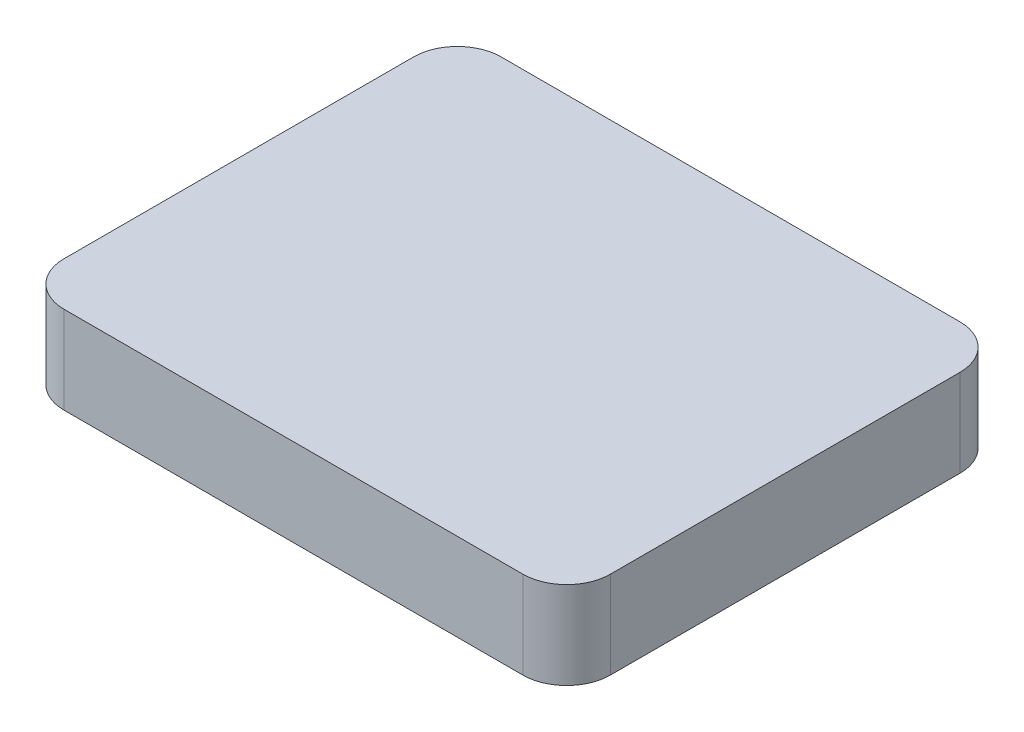
ISO-10303-21;
HEADER;
FILE_DESCRIPTION(('STEP AP214'),'2;1');
FILE_NAME('part.step','',(''),(''),'','','');
FILE_SCHEMA(('AUTOMOTIVE_DESIGN { 1 0 10303 214 1 1 1 1 }'));
ENDSEC;
DATA;
#1=APPLICATION_CONTEXT('core data for automotive mechanical design processes');
#2=APPLICATION_PROTOCOL_DEFINITION('international standard','automotive_design',2000,#1);
#3=PRODUCT_CONTEXT('',#1,'mechanical');
#4=PRODUCT('Part','Part','',(#3));
#5=PRODUCT_RELATED_PRODUCT_CATEGORY('part','',(#4));
#6=PRODUCT_DEFINITION_FORMATION('','',#4);
#7=PRODUCT_DEFINITION_CONTEXT('part definition',#1,'design');
#8=PRODUCT_DEFINITION('design','',#6,#7);
#9=PRODUCT_DEFINITION_SHAPE('','',#8);
#10=(LENGTH_UNIT() NAMED_UNIT(*) SI_UNIT(.MILLI.,.METRE.));
#11=(NAMED_UNIT(*) PLANE_ANGLE_UNIT() SI_UNIT($,.RADIAN.));
#12=(NAMED_UNIT(*) SI_UNIT($,.STERADIAN.) SOLID_ANGLE_UNIT());
#13=UNCERTAINTY_MEASURE_WITH_UNIT(LENGTH_MEASURE(1.E-05),#10,'distance_accuracy_value','');
#14=(GEOMETRIC_REPRESENTATION_CONTEXT(3) GLOBAL_UNCERTAINTY_ASSIGNED_CONTEXT((#13)) GLOBAL_UNIT_ASSIGNED_CONTEXT((#10,
#11,#12)) REPRESENTATION_CONTEXT('',''));
#15=CARTESIAN_POINT('',(0.,0.,0.));
#16=DIRECTION('',(0.,0.,1.));
#17=DIRECTION('',(1.,0.,0.));
#18=AXIS2_PLACEMENT_3D('',#15,#16,#17);
#19=CARTESIAN_POINT('',(125.,40.,-100.));
#20=DIRECTION('',(-1.,0.,0.));
#21=DIRECTION('',(0.,0.,1.));
#22=AXIS2_PLACEMENT_3D('',#19,#20,#21);
#23=PLANE('',#22);
#24=DIRECTION('',(0.,0.,-1.));
#25=VECTOR('',#24,1.);
#26=CARTESIAN_POINT('',(125.,0.,-100.));
#27=LINE('',#26,#25);
#28=CARTESIAN_POINT('',(125.,0.,80.));
#29=VERTEX_POINT('',#28);
#30=CARTESIAN_POINT('',(125.,0.,-80.));
#31=VERTEX_POINT('',#30);
#32=EDGE_CURVE('E162',#29,#31,#27,.T.);
#33=ORIENTED_EDGE('',*,*,#32,.T.);
#34=DIRECTION('',(0.,-1.,0.));
#35=VECTOR('',#34,1.);
#36=CARTESIAN_POINT('',(125.,40.,-80.));
#37=LINE('',#36,#35);
#38=CARTESIAN_POINT('',(125.,40.,-80.));
#39=VERTEX_POINT('',#38);
#40=EDGE_CURVE('E11',#31,#39,#37,.F.);
#41=ORIENTED_EDGE('',*,*,#40,.T.);
#42=DIRECTION('',(0.,0.,-1.));
#43=VECTOR('',#42,1.);
#44=CARTESIAN_POINT('',(125.,40.,-100.));
#45=LINE('',#44,#43);
#46=CARTESIAN_POINT('',(125.,40.,80.));
#47=VERTEX_POINT('',#46);
#48=EDGE_CURVE('E130',#47,#39,#45,.T.);
#49=ORIENTED_EDGE('',*,*,#48,.F.);
#50=DIRECTION('',(0.,-1.,0.));
#51=VECTOR('',#50,1.);
#52=CARTESIAN_POINT('',(125.,40.,80.));
#53=LINE('',#52,#51);
#54=EDGE_CURVE('E46',#47,#29,#53,.T.);
#55=ORIENTED_EDGE('',*,*,#54,.T.);
#56=EDGE_LOOP('',(#33,#41,#49,#55));
#57=FACE_BOUND('',#56,.T.);
#58=ADVANCED_FACE('F38',(#57),#23,.F.);
#59=CARTESIAN_POINT('',(-125.,40.,-100.));
#60=DIRECTION('',(0.,0.,1.));
#61=DIRECTION('',(1.,0.,0.));
#62=AXIS2_PLACEMENT_3D('',#59,#60,#61);
#63=PLANE('',#62);
#64=DIRECTION('',(-1.,0.,0.));
#65=VECTOR('',#64,1.);
#66=CARTESIAN_POINT('',(-125.,0.,-100.));
#67=LINE('',#66,#65);
#68=CARTESIAN_POINT('',(105.,0.,-100.));
#69=VERTEX_POINT('',#68);
#70=CARTESIAN_POINT('',(-105.,0.,-100.));
#71=VERTEX_POINT('',#70);
#72=EDGE_CURVE('E135',#69,#71,#67,.T.);
#73=ORIENTED_EDGE('',*,*,#72,.T.);
#74=DIRECTION('',(0.,-1.,0.));
#75=VECTOR('',#74,1.);
#76=CARTESIAN_POINT('',(-105.,40.,-100.));
#77=LINE('',#76,#75);
#78=CARTESIAN_POINT('',(-105.,40.,-100.));
#79=VERTEX_POINT('',#78);
#80=EDGE_CURVE('E53',#71,#79,#77,.F.);
#81=ORIENTED_EDGE('',*,*,#80,.T.);
#82=DIRECTION('',(-1.,0.,0.));
#83=VECTOR('',#82,1.);
#84=CARTESIAN_POINT('',(-125.,40.,-100.));
#85=LINE('',#84,#83);
#86=CARTESIAN_POINT('',(105.,40.,-100.));
#87=VERTEX_POINT('',#86);
#88=EDGE_CURVE('E133',#87,#79,#85,.T.);
#89=ORIENTED_EDGE('',*,*,#88,.F.);
#90=DIRECTION('',(0.,-1.,0.));
#91=VECTOR('',#90,1.);
#92=CARTESIAN_POINT('',(105.,40.,-100.));
#93=LINE('',#92,#91);
#94=EDGE_CURVE('E154',#87,#69,#93,.T.);
#95=ORIENTED_EDGE('',*,*,#94,.T.);
#96=EDGE_LOOP('',(#73,#81,#89,#95));
#97=FACE_BOUND('',#96,.T.);
#98=ADVANCED_FACE('F182',(#97),#63,.F.);
#99=CARTESIAN_POINT('',(-125.,40.,-100.));
#100=DIRECTION('',(1.,0.,0.));
#101=DIRECTION('',(0.,0.,-1.));
#102=AXIS2_PLACEMENT_3D('',#99,#100,#101);
#103=PLANE('',#102);
#104=DIRECTION('',(0.,0.,1.));
#105=VECTOR('',#104,1.);
#106=CARTESIAN_POINT('',(-125.,0.,-100.));
#107=LINE('',#106,#105);
#108=CARTESIAN_POINT('',(-125.,0.,-80.));
#109=VERTEX_POINT('',#108);
#110=CARTESIAN_POINT('',(-125.,0.,80.));
#111=VERTEX_POINT('',#110);
#112=EDGE_CURVE('E131',#109,#111,#107,.T.);
#113=ORIENTED_EDGE('',*,*,#112,.T.);
#114=DIRECTION('',(0.,-1.,0.));
#115=VECTOR('',#114,1.);
#116=CARTESIAN_POINT('',(-125.,40.,80.));
#117=LINE('',#116,#115);
#118=CARTESIAN_POINT('',(-125.,40.,80.));
#119=VERTEX_POINT('',#118);
#120=EDGE_CURVE('E109',#111,#119,#117,.F.);
#121=ORIENTED_EDGE('',*,*,#120,.T.);
#122=DIRECTION('',(0.,0.,1.));
#123=VECTOR('',#122,1.);
#124=CARTESIAN_POINT('',(-125.,40.,-100.));
#125=LINE('',#124,#123);
#126=CARTESIAN_POINT('',(-125.,40.,-80.));
#127=VERTEX_POINT('',#126);
#128=EDGE_CURVE('E170',#127,#119,#125,.T.);
#129=ORIENTED_EDGE('',*,*,#128,.F.);
#130=DIRECTION('',(0.,-1.,0.));
#131=VECTOR('',#130,1.);
#132=CARTESIAN_POINT('',(-125.,40.,-80.));
#133=LINE('',#132,#131);
#134=EDGE_CURVE('E114',#127,#109,#133,.T.);
#135=ORIENTED_EDGE('',*,*,#134,.T.);
#136=EDGE_LOOP('',(#113,#121,#129,#135));
#137=FACE_BOUND('',#136,.T.);
#138=ADVANCED_FACE('F181',(#137),#103,.F.);
#139=CARTESIAN_POINT('',(-125.,40.,100.));
#140=DIRECTION('',(0.,0.,-1.));
#141=DIRECTION('',(-1.,0.,0.));
#142=AXIS2_PLACEMENT_3D('',#139,#140,#141);
#143=PLANE('',#142);
#144=DIRECTION('',(1.,0.,0.));
#145=VECTOR('',#144,1.);
#146=CARTESIAN_POINT('',(-125.,40.,100.));
#147=LINE('',#146,#145);
#148=CARTESIAN_POINT('',(-105.,40.,100.));
#149=VERTEX_POINT('',#148);
#150=CARTESIAN_POINT('',(105.,40.,100.));
#151=VERTEX_POINT('',#150);
#152=EDGE_CURVE('E124',#149,#151,#147,.T.);
#153=ORIENTED_EDGE('',*,*,#152,.F.);
#154=DIRECTION('',(0.,-1.,0.));
#155=VECTOR('',#154,1.);
#156=CARTESIAN_POINT('',(-105.,40.,100.));
#157=LINE('',#156,#155);
#158=CARTESIAN_POINT('',(-105.,0.,100.));
#159=VERTEX_POINT('',#158);
#160=EDGE_CURVE('E108',#149,#159,#157,.T.);
#161=ORIENTED_EDGE('',*,*,#160,.T.);
#162=DIRECTION('',(1.,0.,0.));
#163=VECTOR('',#162,1.);
#164=CARTESIAN_POINT('',(-125.,0.,100.));
#165=LINE('',#164,#163);
#166=CARTESIAN_POINT('',(105.,0.,100.));
#167=VERTEX_POINT('',#166);
#168=EDGE_CURVE('E121',#159,#167,#165,.T.);
#169=ORIENTED_EDGE('',*,*,#168,.T.);
#170=DIRECTION('',(0.,-1.,0.));
#171=VECTOR('',#170,1.);
#172=CARTESIAN_POINT('',(105.,40.,100.));
#173=LINE('',#172,#171);
#174=EDGE_CURVE('E126',#167,#151,#173,.F.);
#175=ORIENTED_EDGE('',*,*,#174,.T.);
#176=EDGE_LOOP('',(#153,#161,#169,#175));
#177=FACE_BOUND('',#176,.T.);
#178=ADVANCED_FACE('F120',(#177),#143,.F.);
#179=CARTESIAN_POINT('',(0.,40.,0.));
#180=DIRECTION('',(0.,1.,0.));
#181=DIRECTION('',(0.,0.,1.));
#182=AXIS2_PLACEMENT_3D('',#179,#180,#181);
#183=PLANE('',#182);
#184=ORIENTED_EDGE('',*,*,#128,.T.);
#185=CARTESIAN_POINT('',(-105.,40.,80.));
#186=DIRECTION('',(0.,1.,0.));
#187=DIRECTION('',(0.,0.,1.));
#188=AXIS2_PLACEMENT_3D('',#185,#186,#187);
#189=CIRCLE('',#188,20.);
#190=EDGE_CURVE('E152',#119,#149,#189,.T.);
#191=ORIENTED_EDGE('',*,*,#190,.T.);
#192=ORIENTED_EDGE('',*,*,#152,.T.);
#193=CARTESIAN_POINT('',(105.,40.,80.));
#194=DIRECTION('',(0.,1.,0.));
#195=DIRECTION('',(0.,0.,1.));
#196=AXIS2_PLACEMENT_3D('',#193,#194,#195);
#197=CIRCLE('',#196,20.);
#198=EDGE_CURVE('E147',#151,#47,#197,.T.);
#199=ORIENTED_EDGE('',*,*,#198,.T.);
#200=ORIENTED_EDGE('',*,*,#48,.T.);
#201=CARTESIAN_POINT('',(105.,40.,-80.));
#202=DIRECTION('',(0.,1.,0.));
#203=DIRECTION('',(0.,0.,1.));
#204=AXIS2_PLACEMENT_3D('',#201,#202,#203);
#205=CIRCLE('',#204,20.);
#206=EDGE_CURVE('E60',#39,#87,#205,.T.);
#207=ORIENTED_EDGE('',*,*,#206,.T.);
#208=ORIENTED_EDGE('',*,*,#88,.T.);
#209=CARTESIAN_POINT('',(-105.,40.,-80.));
#210=DIRECTION('',(0.,1.,0.));
#211=DIRECTION('',(0.,0.,1.));
#212=AXIS2_PLACEMENT_3D('',#209,#210,#211);
#213=CIRCLE('',#212,20.);
#214=EDGE_CURVE('E150',#79,#127,#213,.T.);
#215=ORIENTED_EDGE('',*,*,#214,.T.);
#216=EDGE_LOOP('',(#184,#191,#192,#199,#200,#207,#208,#215));
#217=FACE_BOUND('',#216,.T.);
#218=ADVANCED_FACE('F174',(#217),#183,.T.);
#219=CARTESIAN_POINT('',(0.,0.,0.));
#220=DIRECTION('',(0.,1.,0.));
#221=DIRECTION('',(0.,0.,1.));
#222=AXIS2_PLACEMENT_3D('',#219,#220,#221);
#223=PLANE('',#222);
#224=ORIENTED_EDGE('',*,*,#168,.F.);
#225=CARTESIAN_POINT('',(-105.,0.,80.));
#226=DIRECTION('',(0.,1.,0.));
#227=DIRECTION('',(0.,0.,1.));
#228=AXIS2_PLACEMENT_3D('',#225,#226,#227);
#229=CIRCLE('',#228,20.);
#230=EDGE_CURVE('E104',#159,#111,#229,.F.);
#231=ORIENTED_EDGE('',*,*,#230,.T.);
#232=ORIENTED_EDGE('',*,*,#112,.F.);
#233=CARTESIAN_POINT('',(-105.,0.,-80.));
#234=DIRECTION('',(0.,1.,0.));
#235=DIRECTION('',(0.,0.,1.));
#236=AXIS2_PLACEMENT_3D('',#233,#234,#235);
#237=CIRCLE('',#236,20.);
#238=EDGE_CURVE('E115',#109,#71,#237,.F.);
#239=ORIENTED_EDGE('',*,*,#238,.T.);
#240=ORIENTED_EDGE('',*,*,#72,.F.);
#241=CARTESIAN_POINT('',(105.,0.,-80.));
#242=DIRECTION('',(0.,1.,0.));
#243=DIRECTION('',(0.,0.,1.));
#244=AXIS2_PLACEMENT_3D('',#241,#242,#243);
#245=CIRCLE('',#244,20.);
#246=EDGE_CURVE('E141',#69,#31,#245,.F.);
#247=ORIENTED_EDGE('',*,*,#246,.T.);
#248=ORIENTED_EDGE('',*,*,#32,.F.);
#249=CARTESIAN_POINT('',(105.,0.,80.));
#250=DIRECTION('',(0.,1.,0.));
#251=DIRECTION('',(0.,0.,1.));
#252=AXIS2_PLACEMENT_3D('',#249,#250,#251);
#253=CIRCLE('',#252,20.);
#254=EDGE_CURVE('E125',#29,#167,#253,.F.);
#255=ORIENTED_EDGE('',*,*,#254,.T.);
#256=EDGE_LOOP('',(#224,#231,#232,#239,#240,#247,#248,#255));
#257=FACE_BOUND('',#256,.T.);
#258=ADVANCED_FACE('F128',(#257),#223,.F.);
#259=CARTESIAN_POINT('',(-105.,40.,80.));
#260=DIRECTION('',(0.,-1.,0.));
#261=DIRECTION('',(0.,0.,-1.));
#262=AXIS2_PLACEMENT_3D('',#259,#260,#261);
#263=CYLINDRICAL_SURFACE('',#262,20.);
#264=ORIENTED_EDGE('',*,*,#190,.F.);
#265=ORIENTED_EDGE('',*,*,#120,.F.);
#266=ORIENTED_EDGE('',*,*,#230,.F.);
#267=ORIENTED_EDGE('',*,*,#160,.F.);
#268=EDGE_LOOP('',(#264,#265,#266,#267));
#269=FACE_BOUND('',#268,.T.);
#270=ADVANCED_FACE('F107',(#269),#263,.T.);
#271=CARTESIAN_POINT('',(-105.,40.,-80.));
#272=DIRECTION('',(0.,-1.,0.));
#273=DIRECTION('',(0.,0.,-1.));
#274=AXIS2_PLACEMENT_3D('',#271,#272,#273);
#275=CYLINDRICAL_SURFACE('',#274,20.);
#276=ORIENTED_EDGE('',*,*,#214,.F.);
#277=ORIENTED_EDGE('',*,*,#80,.F.);
#278=ORIENTED_EDGE('',*,*,#238,.F.);
#279=ORIENTED_EDGE('',*,*,#134,.F.);
#280=EDGE_LOOP('',(#276,#277,#278,#279));
#281=FACE_BOUND('',#280,.T.);
#282=ADVANCED_FACE('F179',(#281),#275,.T.);
#283=CARTESIAN_POINT('',(105.,40.,-80.));
#284=DIRECTION('',(0.,-1.,0.));
#285=DIRECTION('',(0.,0.,-1.));
#286=AXIS2_PLACEMENT_3D('',#283,#284,#285);
#287=CYLINDRICAL_SURFACE('',#286,20.);
#288=ORIENTED_EDGE('',*,*,#206,.F.);
#289=ORIENTED_EDGE('',*,*,#40,.F.);
#290=ORIENTED_EDGE('',*,*,#246,.F.);
#291=ORIENTED_EDGE('',*,*,#94,.F.);
#292=EDGE_LOOP('',(#288,#289,#290,#291));
#293=FACE_BOUND('',#292,.T.);
#294=ADVANCED_FACE('F184',(#293),#287,.T.);
#295=CARTESIAN_POINT('',(105.,40.,80.));
#296=DIRECTION('',(0.,-1.,0.));
#297=DIRECTION('',(0.,0.,-1.));
#298=AXIS2_PLACEMENT_3D('',#295,#296,#297);
#299=CYLINDRICAL_SURFACE('',#298,20.);
#300=ORIENTED_EDGE('',*,*,#198,.F.);
#301=ORIENTED_EDGE('',*,*,#174,.F.);
#302=ORIENTED_EDGE('',*,*,#254,.F.);
#303=ORIENTED_EDGE('',*,*,#54,.F.);
#304=EDGE_LOOP('',(#300,#301,#302,#303));
#305=FACE_BOUND('',#304,.T.);
#306=ADVANCED_FACE('F40',(#305),#299,.T.);
#307=CLOSED_SHELL('',(#58,#98,#138,#178,#218,#258,#270,#282,#294,#306));
#308=MANIFOLD_SOLID_BREP('B2',#307);
#309=ADVANCED_BREP_SHAPE_REPRESENTATION('',(#18,#308),#14);
#310=SHAPE_DEFINITION_REPRESENTATION(#9,#309);
ENDSEC;
END-ISO-10303-21;
